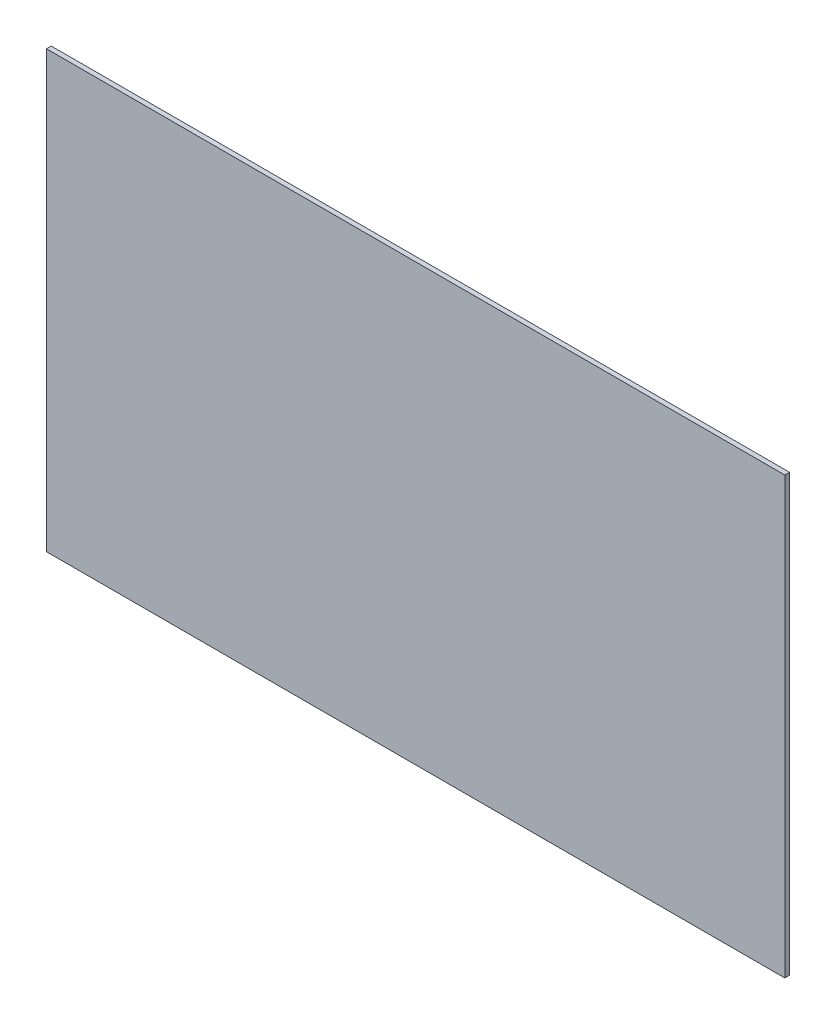
ISO-10303-21;
HEADER;
FILE_DESCRIPTION(('STEP AP214'),'2;1');
FILE_NAME('part.step','',(''),(''),'','','');
FILE_SCHEMA(('AUTOMOTIVE_DESIGN { 1 0 10303 214 1 1 1 1 }'));
ENDSEC;
DATA;
#1=APPLICATION_CONTEXT('core data for automotive mechanical design processes');
#2=APPLICATION_PROTOCOL_DEFINITION('international standard','automotive_design',2000,#1);
#3=PRODUCT_CONTEXT('',#1,'mechanical');
#4=PRODUCT('Part','Part','',(#3));
#5=PRODUCT_RELATED_PRODUCT_CATEGORY('part','',(#4));
#6=PRODUCT_DEFINITION_FORMATION('','',#4);
#7=PRODUCT_DEFINITION_CONTEXT('part definition',#1,'design');
#8=PRODUCT_DEFINITION('design','',#6,#7);
#9=PRODUCT_DEFINITION_SHAPE('','',#8);
#10=(LENGTH_UNIT() NAMED_UNIT(*) SI_UNIT(.MILLI.,.METRE.));
#11=(NAMED_UNIT(*) PLANE_ANGLE_UNIT() SI_UNIT($,.RADIAN.));
#12=(NAMED_UNIT(*) SI_UNIT($,.STERADIAN.) SOLID_ANGLE_UNIT());
#13=UNCERTAINTY_MEASURE_WITH_UNIT(LENGTH_MEASURE(1.E-05),#10,'distance_accuracy_value','');
#14=(GEOMETRIC_REPRESENTATION_CONTEXT(3) GLOBAL_UNCERTAINTY_ASSIGNED_CONTEXT((#13)) GLOBAL_UNIT_ASSIGNED_CONTEXT((#10,
#11,#12)) REPRESENTATION_CONTEXT('',''));
#15=CARTESIAN_POINT('',(0.,0.,0.));
#16=DIRECTION('',(0.,0.,1.));
#17=DIRECTION('',(1.,0.,0.));
#18=AXIS2_PLACEMENT_3D('',#15,#16,#17);
#19=CARTESIAN_POINT('',(125.,-73.75,1.6));
#20=DIRECTION('',(-1.,0.,0.));
#21=DIRECTION('',(0.,0.,1.));
#22=AXIS2_PLACEMENT_3D('',#19,#20,#21);
#23=PLANE('',#22);
#24=DIRECTION('',(0.,1.,0.));
#25=VECTOR('',#24,1.);
#26=CARTESIAN_POINT('',(125.,-73.75,0.));
#27=LINE('',#26,#25);
#28=CARTESIAN_POINT('',(125.,-73.75,0.));
#29=VERTEX_POINT('',#28);
#30=CARTESIAN_POINT('',(125.,73.75,0.));
#31=VERTEX_POINT('',#30);
#32=EDGE_CURVE('E95',#29,#31,#27,.T.);
#33=ORIENTED_EDGE('',*,*,#32,.T.);
#34=DIRECTION('',(0.,0.,-1.));
#35=VECTOR('',#34,1.);
#36=CARTESIAN_POINT('',(125.,73.75,1.6));
#37=LINE('',#36,#35);
#38=CARTESIAN_POINT('',(125.,73.75,1.6));
#39=VERTEX_POINT('',#38);
#40=EDGE_CURVE('E11',#39,#31,#37,.T.);
#41=ORIENTED_EDGE('',*,*,#40,.F.);
#42=DIRECTION('',(0.,1.,0.));
#43=VECTOR('',#42,1.);
#44=CARTESIAN_POINT('',(125.,-73.75,1.6));
#45=LINE('',#44,#43);
#46=CARTESIAN_POINT('',(125.,-73.75,1.6));
#47=VERTEX_POINT('',#46);
#48=EDGE_CURVE('E83',#47,#39,#45,.T.);
#49=ORIENTED_EDGE('',*,*,#48,.F.);
#50=DIRECTION('',(0.,0.,-1.));
#51=VECTOR('',#50,1.);
#52=CARTESIAN_POINT('',(125.,-73.75,1.6));
#53=LINE('',#52,#51);
#54=EDGE_CURVE('E91',#47,#29,#53,.T.);
#55=ORIENTED_EDGE('',*,*,#54,.T.);
#56=EDGE_LOOP('',(#33,#41,#49,#55));
#57=FACE_BOUND('',#56,.T.);
#58=ADVANCED_FACE('F32',(#57),#23,.F.);
#59=CARTESIAN_POINT('',(-125.,73.75,1.6));
#60=DIRECTION('',(0.,-1.,0.));
#61=DIRECTION('',(0.,0.,-1.));
#62=AXIS2_PLACEMENT_3D('',#59,#60,#61);
#63=PLANE('',#62);
#64=DIRECTION('',(-1.,0.,0.));
#65=VECTOR('',#64,1.);
#66=CARTESIAN_POINT('',(-125.,73.75,0.));
#67=LINE('',#66,#65);
#68=CARTESIAN_POINT('',(-125.,73.75,0.));
#69=VERTEX_POINT('',#68);
#70=EDGE_CURVE('E87',#31,#69,#67,.T.);
#71=ORIENTED_EDGE('',*,*,#70,.T.);
#72=DIRECTION('',(0.,0.,-1.));
#73=VECTOR('',#72,1.);
#74=CARTESIAN_POINT('',(-125.,73.75,1.6));
#75=LINE('',#74,#73);
#76=CARTESIAN_POINT('',(-125.,73.75,1.6));
#77=VERTEX_POINT('',#76);
#78=EDGE_CURVE('E40',#77,#69,#75,.T.);
#79=ORIENTED_EDGE('',*,*,#78,.F.);
#80=DIRECTION('',(-1.,0.,0.));
#81=VECTOR('',#80,1.);
#82=CARTESIAN_POINT('',(-125.,73.75,1.6));
#83=LINE('',#82,#81);
#84=EDGE_CURVE('E78',#39,#77,#83,.T.);
#85=ORIENTED_EDGE('',*,*,#84,.F.);
#86=ORIENTED_EDGE('',*,*,#40,.T.);
#87=EDGE_LOOP('',(#71,#79,#85,#86));
#88=FACE_BOUND('',#87,.T.);
#89=ADVANCED_FACE('F86',(#88),#63,.F.);
#90=CARTESIAN_POINT('',(-125.,-73.75,1.6));
#91=DIRECTION('',(1.,0.,0.));
#92=DIRECTION('',(0.,0.,-1.));
#93=AXIS2_PLACEMENT_3D('',#90,#91,#92);
#94=PLANE('',#93);
#95=DIRECTION('',(0.,-1.,0.));
#96=VECTOR('',#95,1.);
#97=CARTESIAN_POINT('',(-125.,-73.75,0.));
#98=LINE('',#97,#96);
#99=CARTESIAN_POINT('',(-125.,-73.75,0.));
#100=VERTEX_POINT('',#99);
#101=EDGE_CURVE('E65',#69,#100,#98,.T.);
#102=ORIENTED_EDGE('',*,*,#101,.T.);
#103=DIRECTION('',(0.,0.,-1.));
#104=VECTOR('',#103,1.);
#105=CARTESIAN_POINT('',(-125.,-73.75,1.6));
#106=LINE('',#105,#104);
#107=CARTESIAN_POINT('',(-125.,-73.75,1.6));
#108=VERTEX_POINT('',#107);
#109=EDGE_CURVE('E88',#108,#100,#106,.T.);
#110=ORIENTED_EDGE('',*,*,#109,.F.);
#111=DIRECTION('',(0.,-1.,0.));
#112=VECTOR('',#111,1.);
#113=CARTESIAN_POINT('',(-125.,-73.75,1.6));
#114=LINE('',#113,#112);
#115=EDGE_CURVE('E81',#77,#108,#114,.T.);
#116=ORIENTED_EDGE('',*,*,#115,.F.);
#117=ORIENTED_EDGE('',*,*,#78,.T.);
#118=EDGE_LOOP('',(#102,#110,#116,#117));
#119=FACE_BOUND('',#118,.T.);
#120=ADVANCED_FACE('F89',(#119),#94,.F.);
#121=CARTESIAN_POINT('',(-125.,-73.75,1.6));
#122=DIRECTION('',(0.,1.,0.));
#123=DIRECTION('',(0.,0.,1.));
#124=AXIS2_PLACEMENT_3D('',#121,#122,#123);
#125=PLANE('',#124);
#126=DIRECTION('',(1.,0.,0.));
#127=VECTOR('',#126,1.);
#128=CARTESIAN_POINT('',(-125.,-73.75,0.));
#129=LINE('',#128,#127);
#130=EDGE_CURVE('E71',#100,#29,#129,.T.);
#131=ORIENTED_EDGE('',*,*,#130,.T.);
#132=ORIENTED_EDGE('',*,*,#54,.F.);
#133=DIRECTION('',(1.,0.,0.));
#134=VECTOR('',#133,1.);
#135=CARTESIAN_POINT('',(-125.,-73.75,1.6));
#136=LINE('',#135,#134);
#137=EDGE_CURVE('E48',#108,#47,#136,.T.);
#138=ORIENTED_EDGE('',*,*,#137,.F.);
#139=ORIENTED_EDGE('',*,*,#109,.T.);
#140=EDGE_LOOP('',(#131,#132,#138,#139));
#141=FACE_BOUND('',#140,.T.);
#142=ADVANCED_FACE('F102',(#141),#125,.F.);
#143=CARTESIAN_POINT('',(0.,0.,1.6));
#144=DIRECTION('',(0.,0.,-1.));
#145=DIRECTION('',(-1.,0.,0.));
#146=AXIS2_PLACEMENT_3D('',#143,#144,#145);
#147=PLANE('',#146);
#148=ORIENTED_EDGE('',*,*,#48,.T.);
#149=ORIENTED_EDGE('',*,*,#84,.T.);
#150=ORIENTED_EDGE('',*,*,#115,.T.);
#151=ORIENTED_EDGE('',*,*,#137,.T.);
#152=EDGE_LOOP('',(#148,#149,#150,#151));
#153=FACE_BOUND('',#152,.T.);
#154=ADVANCED_FACE('F79',(#153),#147,.F.);
#155=CARTESIAN_POINT('',(0.,0.,0.));
#156=DIRECTION('',(0.,0.,-1.));
#157=DIRECTION('',(-1.,0.,0.));
#158=AXIS2_PLACEMENT_3D('',#155,#156,#157);
#159=PLANE('',#158);
#160=ORIENTED_EDGE('',*,*,#32,.F.);
#161=ORIENTED_EDGE('',*,*,#130,.F.);
#162=ORIENTED_EDGE('',*,*,#101,.F.);
#163=ORIENTED_EDGE('',*,*,#70,.F.);
#164=EDGE_LOOP('',(#160,#161,#162,#163));
#165=FACE_BOUND('',#164,.T.);
#166=ADVANCED_FACE('F105',(#165),#159,.T.);
#167=CLOSED_SHELL('',(#58,#89,#120,#142,#154,#166));
#168=MANIFOLD_SOLID_BREP('B2',#167);
#169=ADVANCED_BREP_SHAPE_REPRESENTATION('',(#18,#168),#14);
#170=SHAPE_DEFINITION_REPRESENTATION(#9,#169);
ENDSEC;
END-ISO-10303-21;
